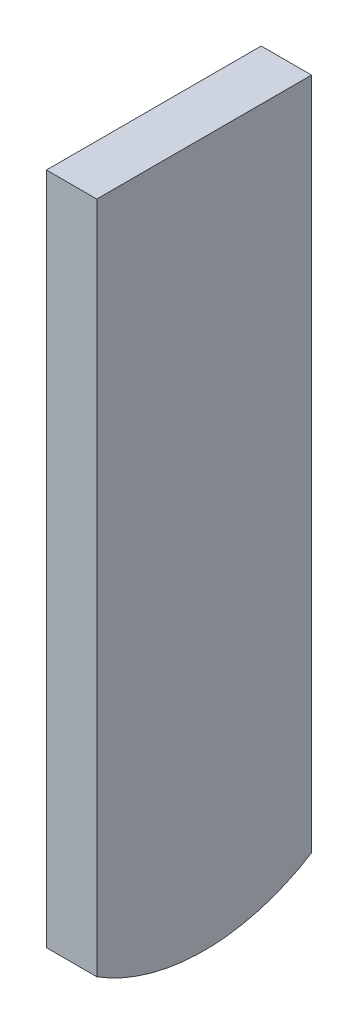
ISO-10303-21;
HEADER;
FILE_DESCRIPTION(('STEP AP214'),'2;1');
FILE_NAME('part.step','',(''),(''),'','','');
FILE_SCHEMA(('AUTOMOTIVE_DESIGN { 1 0 10303 214 1 1 1 1 }'));
ENDSEC;
DATA;
#1=APPLICATION_CONTEXT('core data for automotive mechanical design processes');
#2=APPLICATION_PROTOCOL_DEFINITION('international standard','automotive_design',2000,#1);
#3=PRODUCT_CONTEXT('',#1,'mechanical');
#4=PRODUCT('Part','Part','',(#3));
#5=PRODUCT_RELATED_PRODUCT_CATEGORY('part','',(#4));
#6=PRODUCT_DEFINITION_FORMATION('','',#4);
#7=PRODUCT_DEFINITION_CONTEXT('part definition',#1,'design');
#8=PRODUCT_DEFINITION('design','',#6,#7);
#9=PRODUCT_DEFINITION_SHAPE('','',#8);
#10=(LENGTH_UNIT() NAMED_UNIT(*) SI_UNIT(.MILLI.,.METRE.));
#11=(NAMED_UNIT(*) PLANE_ANGLE_UNIT() SI_UNIT($,.RADIAN.));
#12=(NAMED_UNIT(*) SI_UNIT($,.STERADIAN.) SOLID_ANGLE_UNIT());
#13=UNCERTAINTY_MEASURE_WITH_UNIT(LENGTH_MEASURE(1.E-05),#10,'distance_accuracy_value','');
#14=(GEOMETRIC_REPRESENTATION_CONTEXT(3) GLOBAL_UNCERTAINTY_ASSIGNED_CONTEXT((#13)) GLOBAL_UNIT_ASSIGNED_CONTEXT((#10,
#11,#12)) REPRESENTATION_CONTEXT('',''));
#15=CARTESIAN_POINT('',(0.,0.,0.));
#16=DIRECTION('',(0.,0.,1.));
#17=DIRECTION('',(1.,0.,0.));
#18=AXIS2_PLACEMENT_3D('',#15,#16,#17);
#19=CARTESIAN_POINT('',(28.4434652621026,-15.,-1.11022302462516E-13));
#20=DIRECTION('',(-0.999999999999999,0.,0.));
#21=DIRECTION('',(0.,0.,0.999999999999999));
#22=AXIS2_PLACEMENT_3D('',#19,#20,#21);
#23=CYLINDRICAL_SURFACE('',#22,6.);
#24=DIRECTION('',(-0.999999999999999,0.,0.));
#25=VECTOR('',#24,1.);
#26=CARTESIAN_POINT('',(28.4434652621026,-20.0754310161798,-3.20000000000004));
#27=LINE('',#26,#25);
#28=CARTESIAN_POINT('',(0.749999999999862,-20.0754310161798,-3.20000000000006));
#29=VERTEX_POINT('',#28);
#30=CARTESIAN_POINT('',(-0.750000000000028,-20.0754310161798,-3.20000000000004));
#31=VERTEX_POINT('',#30);
#32=EDGE_CURVE('E79',#29,#31,#27,.T.);
#33=ORIENTED_EDGE('',*,*,#32,.F.);
#34=CARTESIAN_POINT('',(0.749999999999973,-15.,0.));
#35=DIRECTION('',(0.999999999999999,0.,0.));
#36=DIRECTION('',(0.,0.,-0.999999999999999));
#37=AXIS2_PLACEMENT_3D('',#34,#35,#36);
#38=CIRCLE('',#37,6.);
#39=CARTESIAN_POINT('',(0.750000000000028,-20.0754310161798,3.19999999999998));
#40=VERTEX_POINT('',#39);
#41=EDGE_CURVE('E51',#29,#40,#38,.F.);
#42=ORIENTED_EDGE('',*,*,#41,.T.);
#43=DIRECTION('',(-0.999999999999999,0.,0.));
#44=VECTOR('',#43,1.);
#45=CARTESIAN_POINT('',(28.4434652621025,-20.0754310161798,3.19999999999995));
#46=LINE('',#45,#44);
#47=CARTESIAN_POINT('',(-0.749999999999973,-20.0754310161798,3.19999999999998));
#48=VERTEX_POINT('',#47);
#49=EDGE_CURVE('E90',#40,#48,#46,.T.);
#50=ORIENTED_EDGE('',*,*,#49,.T.);
#51=CARTESIAN_POINT('',(-0.750000000000028,-15.,-1.11022302462516E-13));
#52=DIRECTION('',(-0.999999999999999,0.,0.));
#53=DIRECTION('',(0.,0.,0.999999999999999));
#54=AXIS2_PLACEMENT_3D('',#51,#52,#53);
#55=CIRCLE('',#54,6.);
#56=EDGE_CURVE('E59',#48,#31,#55,.F.);
#57=ORIENTED_EDGE('',*,*,#56,.T.);
#58=EDGE_LOOP('',(#33,#42,#50,#57));
#59=FACE_BOUND('',#58,.T.);
#60=ADVANCED_FACE('F34',(#59),#23,.T.);
#61=CARTESIAN_POINT('',(0.750000000000028,-21.,3.19999999999998));
#62=DIRECTION('',(0.999999999999999,0.,0.));
#63=DIRECTION('',(0.,0.,-0.999999999999999));
#64=AXIS2_PLACEMENT_3D('',#61,#62,#63);
#65=PLANE('',#64);
#66=ORIENTED_EDGE('',*,*,#41,.F.);
#67=DIRECTION('',(0.,1.,0.));
#68=VECTOR('',#67,1.);
#69=CARTESIAN_POINT('',(0.749999999999862,-21.,-3.20000000000006));
#70=LINE('',#69,#68);
#71=CARTESIAN_POINT('',(0.749999999999917,0.,-3.20000000000001));
#72=VERTEX_POINT('',#71);
#73=EDGE_CURVE('E38',#29,#72,#70,.T.);
#74=ORIENTED_EDGE('',*,*,#73,.T.);
#75=DIRECTION('',(0.,0.,-0.999999999999999));
#76=VECTOR('',#75,1.);
#77=CARTESIAN_POINT('',(0.750000000000028,0.,3.19999999999998));
#78=LINE('',#77,#76);
#79=CARTESIAN_POINT('',(0.750000000000028,0.,3.19999999999998));
#80=VERTEX_POINT('',#79);
#81=EDGE_CURVE('E88',#80,#72,#78,.T.);
#82=ORIENTED_EDGE('',*,*,#81,.F.);
#83=DIRECTION('',(0.,1.,0.));
#84=VECTOR('',#83,1.);
#85=CARTESIAN_POINT('',(0.750000000000028,-21.,3.19999999999998));
#86=LINE('',#85,#84);
#87=EDGE_CURVE('E11',#40,#80,#86,.T.);
#88=ORIENTED_EDGE('',*,*,#87,.F.);
#89=EDGE_LOOP('',(#66,#74,#82,#88));
#90=FACE_BOUND('',#89,.T.);
#91=ADVANCED_FACE('F36',(#90),#65,.T.);
#92=CARTESIAN_POINT('',(-0.749999999999973,-21.,3.19999999999998));
#93=DIRECTION('',(0.,0.,0.999999999999999));
#94=DIRECTION('',(0.999999999999999,0.,0.));
#95=AXIS2_PLACEMENT_3D('',#92,#93,#94);
#96=PLANE('',#95);
#97=ORIENTED_EDGE('',*,*,#49,.F.);
#98=ORIENTED_EDGE('',*,*,#87,.T.);
#99=DIRECTION('',(0.999999999999999,0.,0.));
#100=VECTOR('',#99,1.);
#101=CARTESIAN_POINT('',(-0.749999999999973,0.,3.19999999999998));
#102=LINE('',#101,#100);
#103=CARTESIAN_POINT('',(-0.749999999999973,0.,3.19999999999998));
#104=VERTEX_POINT('',#103);
#105=EDGE_CURVE('E86',#104,#80,#102,.T.);
#106=ORIENTED_EDGE('',*,*,#105,.F.);
#107=DIRECTION('',(0.,1.,0.));
#108=VECTOR('',#107,1.);
#109=CARTESIAN_POINT('',(-0.749999999999973,-21.,3.19999999999998));
#110=LINE('',#109,#108);
#111=EDGE_CURVE('E43',#48,#104,#110,.T.);
#112=ORIENTED_EDGE('',*,*,#111,.F.);
#113=EDGE_LOOP('',(#97,#98,#106,#112));
#114=FACE_BOUND('',#113,.T.);
#115=ADVANCED_FACE('F108',(#114),#96,.T.);
#116=CARTESIAN_POINT('',(-0.749999999999973,-21.,3.19999999999998));
#117=DIRECTION('',(-0.999999999999999,0.,0.));
#118=DIRECTION('',(0.,0.,0.999999999999999));
#119=AXIS2_PLACEMENT_3D('',#116,#117,#118);
#120=PLANE('',#119);
#121=ORIENTED_EDGE('',*,*,#56,.F.);
#122=ORIENTED_EDGE('',*,*,#111,.T.);
#123=DIRECTION('',(0.,0.,0.999999999999999));
#124=VECTOR('',#123,1.);
#125=CARTESIAN_POINT('',(-0.749999999999973,0.,3.19999999999998));
#126=LINE('',#125,#124);
#127=CARTESIAN_POINT('',(-0.750000000000028,0.,-3.20000000000004));
#128=VERTEX_POINT('',#127);
#129=EDGE_CURVE('E97',#128,#104,#126,.T.);
#130=ORIENTED_EDGE('',*,*,#129,.F.);
#131=DIRECTION('',(0.,1.,0.));
#132=VECTOR('',#131,1.);
#133=CARTESIAN_POINT('',(-0.750000000000028,-21.,-3.20000000000004));
#134=LINE('',#133,#132);
#135=EDGE_CURVE('E85',#31,#128,#134,.T.);
#136=ORIENTED_EDGE('',*,*,#135,.F.);
#137=EDGE_LOOP('',(#121,#122,#130,#136));
#138=FACE_BOUND('',#137,.T.);
#139=ADVANCED_FACE('F103',(#138),#120,.T.);
#140=CARTESIAN_POINT('',(-0.750000000000028,-21.,-3.20000000000004));
#141=DIRECTION('',(0.,0.,-0.999999999999999));
#142=DIRECTION('',(-0.999999999999999,0.,0.));
#143=AXIS2_PLACEMENT_3D('',#140,#141,#142);
#144=PLANE('',#143);
#145=ORIENTED_EDGE('',*,*,#32,.T.);
#146=ORIENTED_EDGE('',*,*,#135,.T.);
#147=DIRECTION('',(-0.999999999999999,0.,0.));
#148=VECTOR('',#147,1.);
#149=CARTESIAN_POINT('',(-0.750000000000028,0.,-3.20000000000004));
#150=LINE('',#149,#148);
#151=EDGE_CURVE('E81',#72,#128,#150,.T.);
#152=ORIENTED_EDGE('',*,*,#151,.F.);
#153=ORIENTED_EDGE('',*,*,#73,.F.);
#154=EDGE_LOOP('',(#145,#146,#152,#153));
#155=FACE_BOUND('',#154,.T.);
#156=ADVANCED_FACE('F78',(#155),#144,.T.);
#157=CARTESIAN_POINT('',(0.,0.,0.));
#158=DIRECTION('',(0.,-1.,0.));
#159=DIRECTION('',(0.,0.,-0.999999999999999));
#160=AXIS2_PLACEMENT_3D('',#157,#158,#159);
#161=PLANE('',#160);
#162=ORIENTED_EDGE('',*,*,#81,.T.);
#163=ORIENTED_EDGE('',*,*,#151,.T.);
#164=ORIENTED_EDGE('',*,*,#129,.T.);
#165=ORIENTED_EDGE('',*,*,#105,.T.);
#166=EDGE_LOOP('',(#162,#163,#164,#165));
#167=FACE_BOUND('',#166,.T.);
#168=ADVANCED_FACE('F106',(#167),#161,.F.);
#169=CLOSED_SHELL('',(#60,#91,#115,#139,#156,#168));
#170=MANIFOLD_SOLID_BREP('B2',#169);
#171=ADVANCED_BREP_SHAPE_REPRESENTATION('',(#18,#170),#14);
#172=SHAPE_DEFINITION_REPRESENTATION(#9,#171);
ENDSEC;
END-ISO-10303-21;
